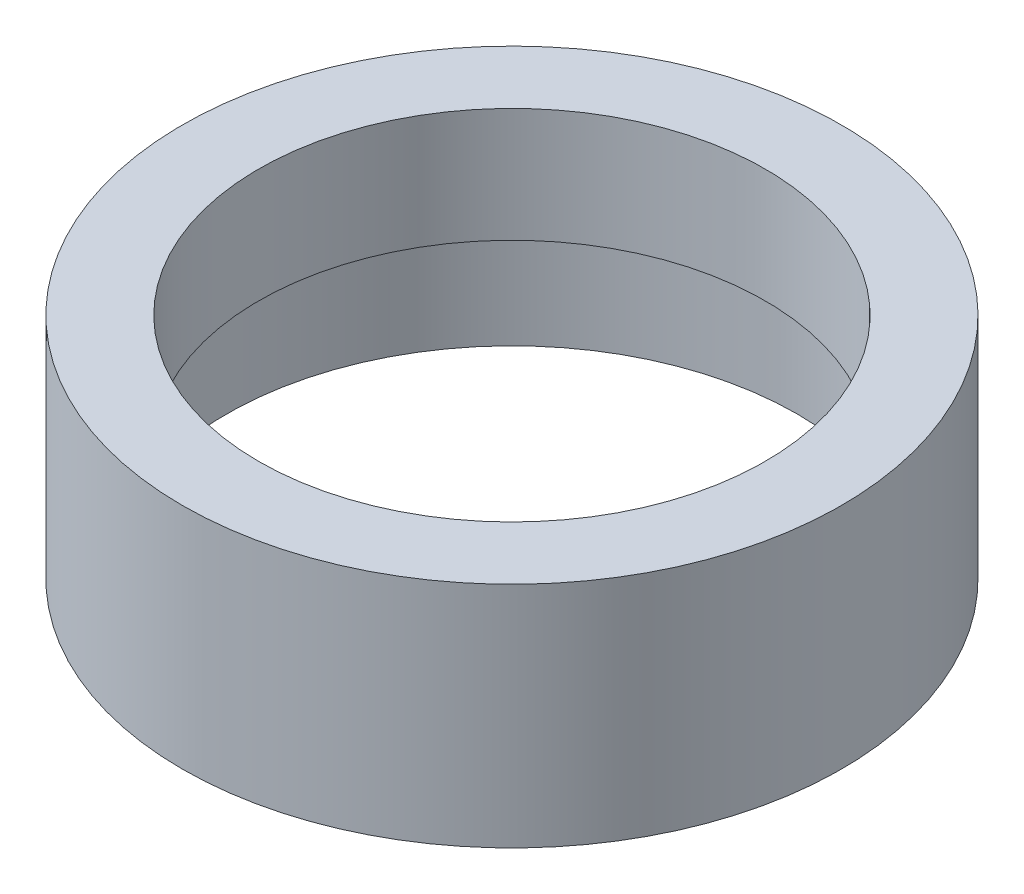
ISO-10303-21;
HEADER;
FILE_DESCRIPTION(('STEP AP214'),'2;1');
FILE_NAME('part.step','',(''),(''),'','','');
FILE_SCHEMA(('AUTOMOTIVE_DESIGN { 1 0 10303 214 1 1 1 1 }'));
ENDSEC;
DATA;
#1=APPLICATION_CONTEXT('core data for automotive mechanical design processes');
#2=APPLICATION_PROTOCOL_DEFINITION('international standard','automotive_design',2000,#1);
#3=PRODUCT_CONTEXT('',#1,'mechanical');
#4=PRODUCT('Part','Part','',(#3));
#5=PRODUCT_RELATED_PRODUCT_CATEGORY('part','',(#4));
#6=PRODUCT_DEFINITION_FORMATION('','',#4);
#7=PRODUCT_DEFINITION_CONTEXT('part definition',#1,'design');
#8=PRODUCT_DEFINITION('design','',#6,#7);
#9=PRODUCT_DEFINITION_SHAPE('','',#8);
#10=(LENGTH_UNIT() NAMED_UNIT(*) SI_UNIT(.MILLI.,.METRE.));
#11=(NAMED_UNIT(*) PLANE_ANGLE_UNIT() SI_UNIT($,.RADIAN.));
#12=(NAMED_UNIT(*) SI_UNIT($,.STERADIAN.) SOLID_ANGLE_UNIT());
#13=UNCERTAINTY_MEASURE_WITH_UNIT(LENGTH_MEASURE(1.E-05),#10,'distance_accuracy_value','');
#14=(GEOMETRIC_REPRESENTATION_CONTEXT(3) GLOBAL_UNCERTAINTY_ASSIGNED_CONTEXT((#13)) GLOBAL_UNIT_ASSIGNED_CONTEXT((#10,
#11,#12)) REPRESENTATION_CONTEXT('',''));
#15=CARTESIAN_POINT('',(0.,0.,0.));
#16=DIRECTION('',(0.,0.,1.));
#17=DIRECTION('',(1.,0.,0.));
#18=AXIS2_PLACEMENT_3D('',#15,#16,#17);
#19=CARTESIAN_POINT('',(15.875,0.,0.));
#20=DIRECTION('',(0.,1.,0.));
#21=DIRECTION('',(0.,0.,1.));
#22=AXIS2_PLACEMENT_3D('',#19,#20,#21);
#23=PLANE('',#22);
#24=CARTESIAN_POINT('',(0.,0.,0.));
#25=DIRECTION('',(0.,1.,0.));
#26=DIRECTION('',(0.,0.,1.));
#27=AXIS2_PLACEMENT_3D('',#24,#25,#26);
#28=CIRCLE('',#27,15.875);
#29=CARTESIAN_POINT('',(0.,0.,15.875));
#30=VERTEX_POINT('',#29);
#31=EDGE_CURVE('E61',#30,#30,#28,.T.);
#32=ORIENTED_EDGE('',*,*,#31,.F.);
#33=EDGE_LOOP('',(#32));
#34=FACE_BOUND('',#33,.T.);
#35=CARTESIAN_POINT('',(0.,0.,0.));
#36=DIRECTION('',(0.,1.,0.));
#37=DIRECTION('',(0.,0.,1.));
#38=AXIS2_PLACEMENT_3D('',#35,#36,#37);
#39=CIRCLE('',#38,13.75);
#40=CARTESIAN_POINT('',(0.,0.,13.75));
#41=VERTEX_POINT('',#40);
#42=EDGE_CURVE('E10',#41,#41,#39,.T.);
#43=ORIENTED_EDGE('',*,*,#42,.T.);
#44=EDGE_LOOP('',(#43));
#45=FACE_BOUND('',#44,.T.);
#46=ADVANCED_FACE('F33',(#34,#45),#23,.F.);
#47=CARTESIAN_POINT('',(0.,60.0208204142554,0.));
#48=DIRECTION('',(0.,1.,0.));
#49=DIRECTION('',(0.,0.,1.));
#50=AXIS2_PLACEMENT_3D('',#47,#48,#49);
#51=CYLINDRICAL_SURFACE('',#50,13.75);
#52=ORIENTED_EDGE('',*,*,#42,.F.);
#53=EDGE_LOOP('',(#52));
#54=FACE_BOUND('',#53,.T.);
#55=CARTESIAN_POINT('',(0.,4.5,0.));
#56=DIRECTION('',(0.,1.,0.));
#57=DIRECTION('',(0.,0.,1.));
#58=AXIS2_PLACEMENT_3D('',#55,#56,#57);
#59=CIRCLE('',#58,13.75);
#60=CARTESIAN_POINT('',(0.,4.5,13.75));
#61=VERTEX_POINT('',#60);
#62=EDGE_CURVE('E39',#61,#61,#59,.T.);
#63=ORIENTED_EDGE('',*,*,#62,.T.);
#64=EDGE_LOOP('',(#63));
#65=FACE_BOUND('',#64,.T.);
#66=ADVANCED_FACE('F68',(#54,#65),#51,.F.);
#67=CARTESIAN_POINT('',(13.75,4.5,0.));
#68=DIRECTION('',(0.,-1.,0.));
#69=DIRECTION('',(0.,0.,-1.));
#70=AXIS2_PLACEMENT_3D('',#67,#68,#69);
#71=PLANE('',#70);
#72=ORIENTED_EDGE('',*,*,#62,.F.);
#73=EDGE_LOOP('',(#72));
#74=FACE_BOUND('',#73,.T.);
#75=CARTESIAN_POINT('',(0.,4.5,0.));
#76=DIRECTION('',(0.,1.,0.));
#77=DIRECTION('',(0.,0.,1.));
#78=AXIS2_PLACEMENT_3D('',#75,#76,#77);
#79=CIRCLE('',#78,14.35);
#80=CARTESIAN_POINT('',(0.,4.5,14.35));
#81=VERTEX_POINT('',#80);
#82=EDGE_CURVE('E43',#81,#81,#79,.T.);
#83=ORIENTED_EDGE('',*,*,#82,.T.);
#84=EDGE_LOOP('',(#83));
#85=FACE_BOUND('',#84,.T.);
#86=ADVANCED_FACE('F72',(#74,#85),#71,.F.);
#87=CARTESIAN_POINT('',(0.,60.0208204142554,0.));
#88=DIRECTION('',(0.,1.,0.));
#89=DIRECTION('',(0.,0.,1.));
#90=AXIS2_PLACEMENT_3D('',#87,#88,#89);
#91=CYLINDRICAL_SURFACE('',#90,14.35);
#92=ORIENTED_EDGE('',*,*,#82,.F.);
#93=EDGE_LOOP('',(#92));
#94=FACE_BOUND('',#93,.T.);
#95=CARTESIAN_POINT('',(0.,5.5,0.));
#96=DIRECTION('',(0.,1.,0.));
#97=DIRECTION('',(0.,0.,1.));
#98=AXIS2_PLACEMENT_3D('',#95,#96,#97);
#99=CIRCLE('',#98,14.35);
#100=CARTESIAN_POINT('',(0.,5.5,14.35));
#101=VERTEX_POINT('',#100);
#102=EDGE_CURVE('E47',#101,#101,#99,.T.);
#103=ORIENTED_EDGE('',*,*,#102,.T.);
#104=EDGE_LOOP('',(#103));
#105=FACE_BOUND('',#104,.T.);
#106=ADVANCED_FACE('F77',(#94,#105),#91,.F.);
#107=CARTESIAN_POINT('',(14.35,5.5,0.));
#108=DIRECTION('',(0.,1.,0.));
#109=DIRECTION('',(0.,0.,1.));
#110=AXIS2_PLACEMENT_3D('',#107,#108,#109);
#111=PLANE('',#110);
#112=ORIENTED_EDGE('',*,*,#102,.F.);
#113=EDGE_LOOP('',(#112));
#114=FACE_BOUND('',#113,.T.);
#115=CARTESIAN_POINT('',(0.,5.5,0.));
#116=DIRECTION('',(0.,1.,0.));
#117=DIRECTION('',(0.,0.,1.));
#118=AXIS2_PLACEMENT_3D('',#115,#116,#117);
#119=CIRCLE('',#118,12.2);
#120=CARTESIAN_POINT('',(0.,5.5,12.2));
#121=VERTEX_POINT('',#120);
#122=EDGE_CURVE('E52',#121,#121,#119,.T.);
#123=ORIENTED_EDGE('',*,*,#122,.T.);
#124=EDGE_LOOP('',(#123));
#125=FACE_BOUND('',#124,.T.);
#126=ADVANCED_FACE('F83',(#114,#125),#111,.F.);
#127=CARTESIAN_POINT('',(0.,60.0208204142554,0.));
#128=DIRECTION('',(0.,1.,0.));
#129=DIRECTION('',(0.,0.,1.));
#130=AXIS2_PLACEMENT_3D('',#127,#128,#129);
#131=CYLINDRICAL_SURFACE('',#130,12.2);
#132=ORIENTED_EDGE('',*,*,#122,.F.);
#133=EDGE_LOOP('',(#132));
#134=FACE_BOUND('',#133,.T.);
#135=CARTESIAN_POINT('',(0.,11.,0.));
#136=DIRECTION('',(0.,1.,0.));
#137=DIRECTION('',(0.,0.,1.));
#138=AXIS2_PLACEMENT_3D('',#135,#136,#137);
#139=CIRCLE('',#138,12.2);
#140=CARTESIAN_POINT('',(0.,11.,12.2));
#141=VERTEX_POINT('',#140);
#142=EDGE_CURVE('E55',#141,#141,#139,.T.);
#143=ORIENTED_EDGE('',*,*,#142,.T.);
#144=EDGE_LOOP('',(#143));
#145=FACE_BOUND('',#144,.T.);
#146=ADVANCED_FACE('F87',(#134,#145),#131,.F.);
#147=CARTESIAN_POINT('',(12.2,11.,0.));
#148=DIRECTION('',(0.,-1.,0.));
#149=DIRECTION('',(0.,0.,-1.));
#150=AXIS2_PLACEMENT_3D('',#147,#148,#149);
#151=PLANE('',#150);
#152=ORIENTED_EDGE('',*,*,#142,.F.);
#153=EDGE_LOOP('',(#152));
#154=FACE_BOUND('',#153,.T.);
#155=CARTESIAN_POINT('',(0.,11.,0.));
#156=DIRECTION('',(0.,1.,0.));
#157=DIRECTION('',(0.,0.,1.));
#158=AXIS2_PLACEMENT_3D('',#155,#156,#157);
#159=CIRCLE('',#158,15.875);
#160=CARTESIAN_POINT('',(0.,11.,15.875));
#161=VERTEX_POINT('',#160);
#162=EDGE_CURVE('E58',#161,#161,#159,.T.);
#163=ORIENTED_EDGE('',*,*,#162,.T.);
#164=EDGE_LOOP('',(#163));
#165=FACE_BOUND('',#164,.T.);
#166=ADVANCED_FACE('F91',(#154,#165),#151,.F.);
#167=CARTESIAN_POINT('',(0.,60.0208204142554,0.));
#168=DIRECTION('',(0.,1.,0.));
#169=DIRECTION('',(0.,0.,1.));
#170=AXIS2_PLACEMENT_3D('',#167,#168,#169);
#171=CYLINDRICAL_SURFACE('',#170,15.875);
#172=ORIENTED_EDGE('',*,*,#162,.F.);
#173=EDGE_LOOP('',(#172));
#174=FACE_BOUND('',#173,.T.);
#175=ORIENTED_EDGE('',*,*,#31,.T.);
#176=EDGE_LOOP('',(#175));
#177=FACE_BOUND('',#176,.T.);
#178=ADVANCED_FACE('F65',(#174,#177),#171,.T.);
#179=CLOSED_SHELL('',(#46,#66,#86,#106,#126,#146,#166,#178));
#180=MANIFOLD_SOLID_BREP('B2',#179);
#181=ADVANCED_BREP_SHAPE_REPRESENTATION('',(#18,#180),#14);
#182=SHAPE_DEFINITION_REPRESENTATION(#9,#181);
ENDSEC;
END-ISO-10303-21;
